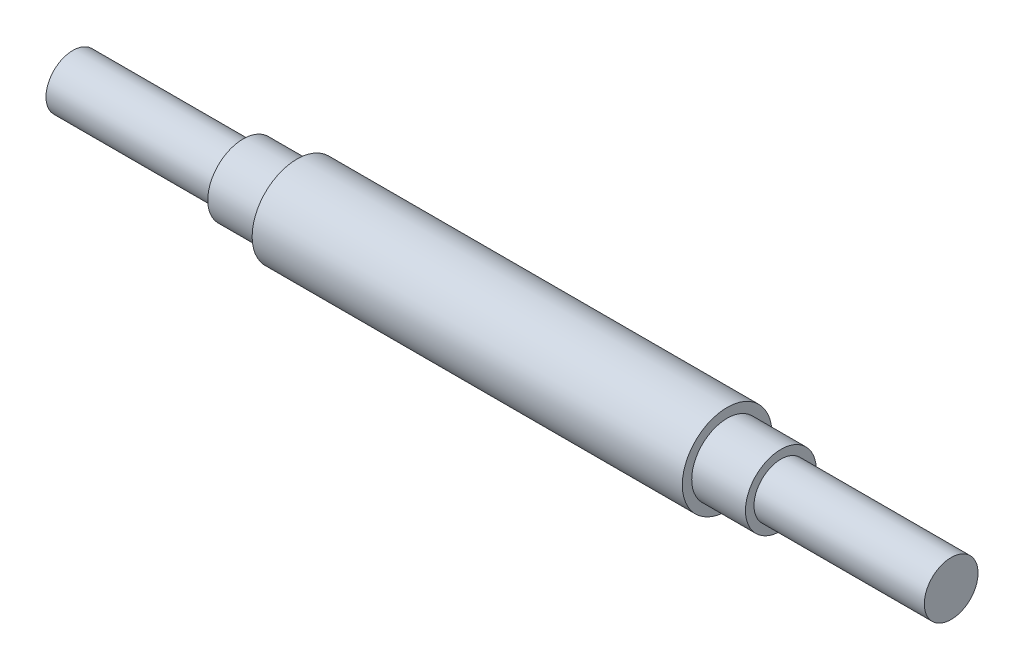
ISO-10303-21;
HEADER;
FILE_DESCRIPTION(('STEP AP214'),'2;1');
FILE_NAME('part.step','',(''),(''),'','','');
FILE_SCHEMA(('AUTOMOTIVE_DESIGN { 1 0 10303 214 1 1 1 1 }'));
ENDSEC;
DATA;
#1=APPLICATION_CONTEXT('core data for automotive mechanical design processes');
#2=APPLICATION_PROTOCOL_DEFINITION('international standard','automotive_design',2000,#1);
#3=PRODUCT_CONTEXT('',#1,'mechanical');
#4=PRODUCT('Part','Part','',(#3));
#5=PRODUCT_RELATED_PRODUCT_CATEGORY('part','',(#4));
#6=PRODUCT_DEFINITION_FORMATION('','',#4);
#7=PRODUCT_DEFINITION_CONTEXT('part definition',#1,'design');
#8=PRODUCT_DEFINITION('design','',#6,#7);
#9=PRODUCT_DEFINITION_SHAPE('','',#8);
#10=(LENGTH_UNIT() NAMED_UNIT(*) SI_UNIT(.MILLI.,.METRE.));
#11=(NAMED_UNIT(*) PLANE_ANGLE_UNIT() SI_UNIT($,.RADIAN.));
#12=(NAMED_UNIT(*) SI_UNIT($,.STERADIAN.) SOLID_ANGLE_UNIT());
#13=UNCERTAINTY_MEASURE_WITH_UNIT(LENGTH_MEASURE(1.E-05),#10,'distance_accuracy_value','');
#14=(GEOMETRIC_REPRESENTATION_CONTEXT(3) GLOBAL_UNCERTAINTY_ASSIGNED_CONTEXT((#13)) GLOBAL_UNIT_ASSIGNED_CONTEXT((#10,
#11,#12)) REPRESENTATION_CONTEXT('',''));
#15=CARTESIAN_POINT('',(0.,0.,0.));
#16=DIRECTION('',(0.,0.,1.));
#17=DIRECTION('',(1.,0.,0.));
#18=AXIS2_PLACEMENT_3D('',#15,#16,#17);
#19=CARTESIAN_POINT('',(-27.3626373626374,3.,0.));
#20=DIRECTION('',(1.,0.,0.));
#21=DIRECTION('',(0.,0.,-1.));
#22=AXIS2_PLACEMENT_3D('',#19,#20,#21);
#23=PLANE('',#22);
#24=CARTESIAN_POINT('',(-27.3626373626374,0.,0.));
#25=DIRECTION('',(-1.,0.,0.));
#26=DIRECTION('',(0.,0.,1.));
#27=AXIS2_PLACEMENT_3D('',#24,#25,#26);
#28=CIRCLE('',#27,3.);
#29=CARTESIAN_POINT('',(-27.3626373626374,0.,3.));
#30=VERTEX_POINT('',#29);
#31=EDGE_CURVE('E64',#30,#30,#28,.T.);
#32=ORIENTED_EDGE('',*,*,#31,.T.);
#33=EDGE_LOOP('',(#32));
#34=FACE_BOUND('',#33,.T.);
#35=ADVANCED_FACE('F30',(#34),#23,.F.);
#36=CARTESIAN_POINT('',(70.6373626373626,0.,0.));
#37=DIRECTION('',(-1.,0.,0.));
#38=DIRECTION('',(0.,0.,1.));
#39=AXIS2_PLACEMENT_3D('',#36,#37,#38);
#40=PLANE('',#39);
#41=CARTESIAN_POINT('',(70.6373626373626,0.,0.));
#42=DIRECTION('',(-1.,0.,0.));
#43=DIRECTION('',(0.,0.,1.));
#44=AXIS2_PLACEMENT_3D('',#41,#42,#43);
#45=CIRCLE('',#44,3.00000000000003);
#46=CARTESIAN_POINT('',(70.6373626373626,0.,3.00000000000003));
#47=VERTEX_POINT('',#46);
#48=EDGE_CURVE('E10',#47,#47,#45,.T.);
#49=ORIENTED_EDGE('',*,*,#48,.F.);
#50=EDGE_LOOP('',(#49));
#51=FACE_BOUND('',#50,.T.);
#52=ADVANCED_FACE('F118',(#51),#40,.F.);
#53=CARTESIAN_POINT('',(-47.9120879120879,0.,0.));
#54=DIRECTION('',(-1.,0.,0.));
#55=DIRECTION('',(0.,0.,1.));
#56=AXIS2_PLACEMENT_3D('',#53,#54,#55);
#57=CYLINDRICAL_SURFACE('',#56,3.00000000000003);
#58=CARTESIAN_POINT('',(51.6373626373626,0.,0.));
#59=DIRECTION('',(-1.,0.,0.));
#60=DIRECTION('',(0.,0.,1.));
#61=AXIS2_PLACEMENT_3D('',#58,#59,#60);
#62=CIRCLE('',#61,3.00000000000003);
#63=CARTESIAN_POINT('',(51.6373626373626,0.,3.00000000000003));
#64=VERTEX_POINT('',#63);
#65=EDGE_CURVE('E36',#64,#64,#62,.T.);
#66=ORIENTED_EDGE('',*,*,#65,.F.);
#67=EDGE_LOOP('',(#66));
#68=FACE_BOUND('',#67,.T.);
#69=ORIENTED_EDGE('',*,*,#48,.T.);
#70=EDGE_LOOP('',(#69));
#71=FACE_BOUND('',#70,.T.);
#72=ADVANCED_FACE('F113',(#68,#71),#57,.T.);
#73=CARTESIAN_POINT('',(51.6373626373626,3.00000000000003,0.));
#74=DIRECTION('',(-1.,0.,0.));
#75=DIRECTION('',(0.,0.,1.));
#76=AXIS2_PLACEMENT_3D('',#73,#74,#75);
#77=PLANE('',#76);
#78=CARTESIAN_POINT('',(51.6373626373626,0.,0.));
#79=DIRECTION('',(-1.,0.,0.));
#80=DIRECTION('',(0.,0.,1.));
#81=AXIS2_PLACEMENT_3D('',#78,#79,#80);
#82=CIRCLE('',#81,3.95000000000003);
#83=CARTESIAN_POINT('',(51.6373626373626,0.,3.95000000000003));
#84=VERTEX_POINT('',#83);
#85=EDGE_CURVE('E40',#84,#84,#82,.T.);
#86=ORIENTED_EDGE('',*,*,#85,.F.);
#87=EDGE_LOOP('',(#86));
#88=FACE_BOUND('',#87,.T.);
#89=ORIENTED_EDGE('',*,*,#65,.T.);
#90=EDGE_LOOP('',(#89));
#91=FACE_BOUND('',#90,.T.);
#92=ADVANCED_FACE('F108',(#88,#91),#77,.F.);
#93=CARTESIAN_POINT('',(-47.9120879120879,0.,0.));
#94=DIRECTION('',(-1.,0.,0.));
#95=DIRECTION('',(0.,0.,1.));
#96=AXIS2_PLACEMENT_3D('',#93,#94,#95);
#97=CYLINDRICAL_SURFACE('',#96,3.95000000000003);
#98=CARTESIAN_POINT('',(45.6373626373626,0.,0.));
#99=DIRECTION('',(-1.,0.,0.));
#100=DIRECTION('',(0.,0.,1.));
#101=AXIS2_PLACEMENT_3D('',#98,#99,#100);
#102=CIRCLE('',#101,3.95000000000003);
#103=CARTESIAN_POINT('',(45.6373626373626,0.,3.95000000000003));
#104=VERTEX_POINT('',#103);
#105=EDGE_CURVE('E44',#104,#104,#102,.T.);
#106=ORIENTED_EDGE('',*,*,#105,.F.);
#107=EDGE_LOOP('',(#106));
#108=FACE_BOUND('',#107,.T.);
#109=ORIENTED_EDGE('',*,*,#85,.T.);
#110=EDGE_LOOP('',(#109));
#111=FACE_BOUND('',#110,.T.);
#112=ADVANCED_FACE('F102',(#108,#111),#97,.T.);
#113=CARTESIAN_POINT('',(45.6373626373626,3.95000000000003,0.));
#114=DIRECTION('',(-1.,0.,0.));
#115=DIRECTION('',(0.,0.,1.));
#116=AXIS2_PLACEMENT_3D('',#113,#114,#115);
#117=PLANE('',#116);
#118=CARTESIAN_POINT('',(45.6373626373626,0.,0.));
#119=DIRECTION('',(-1.,0.,0.));
#120=DIRECTION('',(0.,0.,1.));
#121=AXIS2_PLACEMENT_3D('',#118,#119,#120);
#122=CIRCLE('',#121,5.00000000000002);
#123=CARTESIAN_POINT('',(45.6373626373626,0.,5.00000000000002));
#124=VERTEX_POINT('',#123);
#125=EDGE_CURVE('E49',#124,#124,#122,.T.);
#126=ORIENTED_EDGE('',*,*,#125,.F.);
#127=EDGE_LOOP('',(#126));
#128=FACE_BOUND('',#127,.T.);
#129=ORIENTED_EDGE('',*,*,#105,.T.);
#130=EDGE_LOOP('',(#129));
#131=FACE_BOUND('',#130,.T.);
#132=ADVANCED_FACE('F96',(#128,#131),#117,.F.);
#133=CARTESIAN_POINT('',(-47.9120879120879,0.,0.));
#134=DIRECTION('',(-1.,0.,0.));
#135=DIRECTION('',(0.,0.,1.));
#136=AXIS2_PLACEMENT_3D('',#133,#134,#135);
#137=CYLINDRICAL_SURFACE('',#136,5.00000000000001);
#138=CARTESIAN_POINT('',(-2.36263736263736,0.,0.));
#139=DIRECTION('',(-1.,0.,0.));
#140=DIRECTION('',(0.,0.,1.));
#141=AXIS2_PLACEMENT_3D('',#138,#139,#140);
#142=CIRCLE('',#141,5.00000000000001);
#143=CARTESIAN_POINT('',(-2.36263736263736,0.,5.00000000000001));
#144=VERTEX_POINT('',#143);
#145=EDGE_CURVE('E52',#144,#144,#142,.T.);
#146=ORIENTED_EDGE('',*,*,#145,.F.);
#147=EDGE_LOOP('',(#146));
#148=FACE_BOUND('',#147,.T.);
#149=ORIENTED_EDGE('',*,*,#125,.T.);
#150=EDGE_LOOP('',(#149));
#151=FACE_BOUND('',#150,.T.);
#152=ADVANCED_FACE('F90',(#148,#151),#137,.T.);
#153=CARTESIAN_POINT('',(-2.36263736263736,5.00000000000001,0.));
#154=DIRECTION('',(1.,0.,0.));
#155=DIRECTION('',(0.,0.,-1.));
#156=AXIS2_PLACEMENT_3D('',#153,#154,#155);
#157=PLANE('',#156);
#158=CARTESIAN_POINT('',(-2.36263736263736,0.,0.));
#159=DIRECTION('',(-1.,0.,0.));
#160=DIRECTION('',(0.,0.,1.));
#161=AXIS2_PLACEMENT_3D('',#158,#159,#160);
#162=CIRCLE('',#161,3.95000000000001);
#163=CARTESIAN_POINT('',(-2.36263736263736,0.,3.95000000000001));
#164=VERTEX_POINT('',#163);
#165=EDGE_CURVE('E55',#164,#164,#162,.T.);
#166=ORIENTED_EDGE('',*,*,#165,.F.);
#167=EDGE_LOOP('',(#166));
#168=FACE_BOUND('',#167,.T.);
#169=ORIENTED_EDGE('',*,*,#145,.T.);
#170=EDGE_LOOP('',(#169));
#171=FACE_BOUND('',#170,.T.);
#172=ADVANCED_FACE('F84',(#168,#171),#157,.F.);
#173=CARTESIAN_POINT('',(-47.9120879120879,0.,0.));
#174=DIRECTION('',(-1.,0.,0.));
#175=DIRECTION('',(0.,0.,1.));
#176=AXIS2_PLACEMENT_3D('',#173,#174,#175);
#177=CYLINDRICAL_SURFACE('',#176,3.95000000000001);
#178=CARTESIAN_POINT('',(-8.36263736263736,0.,0.));
#179=DIRECTION('',(-1.,0.,0.));
#180=DIRECTION('',(0.,0.,1.));
#181=AXIS2_PLACEMENT_3D('',#178,#179,#180);
#182=CIRCLE('',#181,3.95);
#183=CARTESIAN_POINT('',(-8.36263736263736,0.,3.95));
#184=VERTEX_POINT('',#183);
#185=EDGE_CURVE('E58',#184,#184,#182,.T.);
#186=ORIENTED_EDGE('',*,*,#185,.F.);
#187=EDGE_LOOP('',(#186));
#188=FACE_BOUND('',#187,.T.);
#189=ORIENTED_EDGE('',*,*,#165,.T.);
#190=EDGE_LOOP('',(#189));
#191=FACE_BOUND('',#190,.T.);
#192=ADVANCED_FACE('F78',(#188,#191),#177,.T.);
#193=CARTESIAN_POINT('',(-8.36263736263736,3.95,0.));
#194=DIRECTION('',(1.,0.,0.));
#195=DIRECTION('',(0.,0.,-1.));
#196=AXIS2_PLACEMENT_3D('',#193,#194,#195);
#197=PLANE('',#196);
#198=CARTESIAN_POINT('',(-8.36263736263736,0.,0.));
#199=DIRECTION('',(-1.,0.,0.));
#200=DIRECTION('',(0.,0.,1.));
#201=AXIS2_PLACEMENT_3D('',#198,#199,#200);
#202=CIRCLE('',#201,3.);
#203=CARTESIAN_POINT('',(-8.36263736263736,0.,3.));
#204=VERTEX_POINT('',#203);
#205=EDGE_CURVE('E61',#204,#204,#202,.T.);
#206=ORIENTED_EDGE('',*,*,#205,.F.);
#207=EDGE_LOOP('',(#206));
#208=FACE_BOUND('',#207,.T.);
#209=ORIENTED_EDGE('',*,*,#185,.T.);
#210=EDGE_LOOP('',(#209));
#211=FACE_BOUND('',#210,.T.);
#212=ADVANCED_FACE('F72',(#208,#211),#197,.F.);
#213=CARTESIAN_POINT('',(-47.9120879120879,0.,0.));
#214=DIRECTION('',(-1.,0.,0.));
#215=DIRECTION('',(0.,0.,1.));
#216=AXIS2_PLACEMENT_3D('',#213,#214,#215);
#217=CYLINDRICAL_SURFACE('',#216,3.);
#218=ORIENTED_EDGE('',*,*,#31,.F.);
#219=EDGE_LOOP('',(#218));
#220=FACE_BOUND('',#219,.T.);
#221=ORIENTED_EDGE('',*,*,#205,.T.);
#222=EDGE_LOOP('',(#221));
#223=FACE_BOUND('',#222,.T.);
#224=ADVANCED_FACE('F69',(#220,#223),#217,.T.);
#225=CLOSED_SHELL('',(#35,#52,#72,#92,#112,#132,#152,#172,#192,#212,#224));
#226=MANIFOLD_SOLID_BREP('B2',#225);
#227=ADVANCED_BREP_SHAPE_REPRESENTATION('',(#18,#226),#14);
#228=SHAPE_DEFINITION_REPRESENTATION(#9,#227);
ENDSEC;
END-ISO-10303-21;
